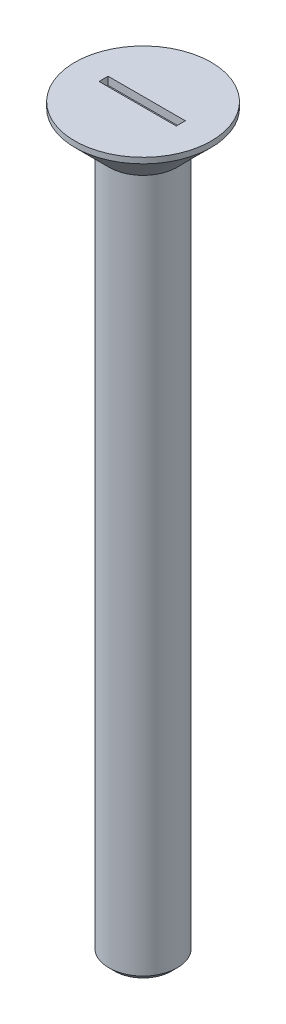
ISO-10303-21;
HEADER;
FILE_DESCRIPTION(('STEP AP214'),'2;1');
FILE_NAME('part.step','',(''),(''),'','','');
FILE_SCHEMA(('AUTOMOTIVE_DESIGN { 1 0 10303 214 1 1 1 1 }'));
ENDSEC;
DATA;
#1=APPLICATION_CONTEXT('core data for automotive mechanical design processes');
#2=APPLICATION_PROTOCOL_DEFINITION('international standard','automotive_design',2000,#1);
#3=PRODUCT_CONTEXT('',#1,'mechanical');
#4=PRODUCT('Part','Part','',(#3));
#5=PRODUCT_RELATED_PRODUCT_CATEGORY('part','',(#4));
#6=PRODUCT_DEFINITION_FORMATION('','',#4);
#7=PRODUCT_DEFINITION_CONTEXT('part definition',#1,'design');
#8=PRODUCT_DEFINITION('design','',#6,#7);
#9=PRODUCT_DEFINITION_SHAPE('','',#8);
#10=(LENGTH_UNIT() NAMED_UNIT(*) SI_UNIT(.MILLI.,.METRE.));
#11=(NAMED_UNIT(*) PLANE_ANGLE_UNIT() SI_UNIT($,.RADIAN.));
#12=(NAMED_UNIT(*) SI_UNIT($,.STERADIAN.) SOLID_ANGLE_UNIT());
#13=UNCERTAINTY_MEASURE_WITH_UNIT(LENGTH_MEASURE(1.E-05),#10,'distance_accuracy_value','');
#14=(GEOMETRIC_REPRESENTATION_CONTEXT(3) GLOBAL_UNCERTAINTY_ASSIGNED_CONTEXT((#13)) GLOBAL_UNIT_ASSIGNED_CONTEXT((#10,
#11,#12)) REPRESENTATION_CONTEXT('',''));
#15=CARTESIAN_POINT('',(0.,0.,0.));
#16=DIRECTION('',(0.,0.,1.));
#17=DIRECTION('',(1.,0.,0.));
#18=AXIS2_PLACEMENT_3D('',#15,#16,#17);
#19=CARTESIAN_POINT('',(0.,65.,0.));
#20=DIRECTION('',(0.,1.,0.));
#21=DIRECTION('',(0.,0.,1.));
#22=AXIS2_PLACEMENT_3D('',#19,#20,#21);
#23=PLANE('',#22);
#24=DIRECTION('',(0.,0.,1.));
#25=VECTOR('',#24,1.);
#26=CARTESIAN_POINT('',(-3.47194242119997,65.,0.4));
#27=LINE('',#26,#25);
#28=CARTESIAN_POINT('',(-3.47194242119997,65.,-0.4));
#29=VERTEX_POINT('',#28);
#30=CARTESIAN_POINT('',(-3.47194242119997,65.,0.4));
#31=VERTEX_POINT('',#30);
#32=EDGE_CURVE('E47',#29,#31,#27,.T.);
#33=ORIENTED_EDGE('',*,*,#32,.F.);
#34=DIRECTION('',(-1.,0.,0.));
#35=VECTOR('',#34,1.);
#36=CARTESIAN_POINT('',(-3.47194242119997,65.,-0.4));
#37=LINE('',#36,#35);
#38=CARTESIAN_POINT('',(3.32060070250861,65.,-0.400000000000001));
#39=VERTEX_POINT('',#38);
#40=EDGE_CURVE('E98',#39,#29,#37,.T.);
#41=ORIENTED_EDGE('',*,*,#40,.F.);
#42=DIRECTION('',(0.,0.,-1.));
#43=VECTOR('',#42,1.);
#44=CARTESIAN_POINT('',(3.32060070250861,65.,0.4));
#45=LINE('',#44,#43);
#46=CARTESIAN_POINT('',(3.32060070250861,65.,0.4));
#47=VERTEX_POINT('',#46);
#48=EDGE_CURVE('E104',#47,#39,#45,.T.);
#49=ORIENTED_EDGE('',*,*,#48,.F.);
#50=DIRECTION('',(1.,0.,0.));
#51=VECTOR('',#50,1.);
#52=CARTESIAN_POINT('',(-3.47194242119997,65.,0.4));
#53=LINE('',#52,#51);
#54=EDGE_CURVE('E82',#31,#47,#53,.T.);
#55=ORIENTED_EDGE('',*,*,#54,.F.);
#56=EDGE_LOOP('',(#33,#41,#49,#55));
#57=FACE_BOUND('',#56,.T.);
#58=CARTESIAN_POINT('',(0.,65.,0.));
#59=DIRECTION('',(0.,-1.,0.));
#60=DIRECTION('',(0.,0.,-1.));
#61=AXIS2_PLACEMENT_3D('',#58,#59,#60);
#62=CIRCLE('',#61,6.);
#63=CARTESIAN_POINT('',(0.,65.,-6.));
#64=VERTEX_POINT('',#63);
#65=EDGE_CURVE('E116',#64,#64,#62,.T.);
#66=ORIENTED_EDGE('',*,*,#65,.F.);
#67=EDGE_LOOP('',(#66));
#68=FACE_BOUND('',#67,.T.);
#69=ADVANCED_FACE('F32',(#57,#68),#23,.T.);
#70=CARTESIAN_POINT('',(0.,-8.5328125,0.));
#71=DIRECTION('',(0.,-1.,0.));
#72=DIRECTION('',(0.,0.,-1.));
#73=AXIS2_PLACEMENT_3D('',#70,#71,#72);
#74=CYLINDRICAL_SURFACE('',#73,6.);
#75=ORIENTED_EDGE('',*,*,#65,.T.);
#76=EDGE_LOOP('',(#75));
#77=FACE_BOUND('',#76,.T.);
#78=CARTESIAN_POINT('',(0.,64.5,0.));
#79=DIRECTION('',(0.,-1.,0.));
#80=DIRECTION('',(0.,0.,-1.));
#81=AXIS2_PLACEMENT_3D('',#78,#79,#80);
#82=CIRCLE('',#81,6.);
#83=CARTESIAN_POINT('',(0.,64.5,-6.));
#84=VERTEX_POINT('',#83);
#85=EDGE_CURVE('E113',#84,#84,#82,.T.);
#86=ORIENTED_EDGE('',*,*,#85,.F.);
#87=EDGE_LOOP('',(#86));
#88=FACE_BOUND('',#87,.T.);
#89=ADVANCED_FACE('F131',(#77,#88),#74,.T.);
#90=CARTESIAN_POINT('',(0.,61.5,0.));
#91=DIRECTION('',(0.,1.,0.));
#92=DIRECTION('',(0.,0.,1.));
#93=AXIS2_PLACEMENT_3D('',#90,#91,#92);
#94=CONICAL_SURFACE('',#93,3.,0.785398163397443);
#95=ORIENTED_EDGE('',*,*,#85,.T.);
#96=EDGE_LOOP('',(#95));
#97=FACE_BOUND('',#96,.T.);
#98=CARTESIAN_POINT('',(0.,61.5,0.));
#99=DIRECTION('',(0.,-1.,0.));
#100=DIRECTION('',(0.,0.,-1.));
#101=AXIS2_PLACEMENT_3D('',#98,#99,#100);
#102=CIRCLE('',#101,3.);
#103=CARTESIAN_POINT('',(0.,61.5,-3.));
#104=VERTEX_POINT('',#103);
#105=EDGE_CURVE('E108',#104,#104,#102,.T.);
#106=ORIENTED_EDGE('',*,*,#105,.F.);
#107=EDGE_LOOP('',(#106));
#108=FACE_BOUND('',#107,.T.);
#109=ADVANCED_FACE('F136',(#97,#108),#94,.T.);
#110=CARTESIAN_POINT('',(0.,-8.5328125,0.));
#111=DIRECTION('',(0.,-1.,0.));
#112=DIRECTION('',(0.,0.,-1.));
#113=AXIS2_PLACEMENT_3D('',#110,#111,#112);
#114=CYLINDRICAL_SURFACE('',#113,3.);
#115=CARTESIAN_POINT('',(0.,0.500000000000002,0.));
#116=DIRECTION('',(0.,-1.,0.));
#117=DIRECTION('',(0.,0.,-1.));
#118=AXIS2_PLACEMENT_3D('',#115,#116,#117);
#119=CIRCLE('',#118,3.);
#120=CARTESIAN_POINT('',(0.,0.500000000000002,-3.));
#121=VERTEX_POINT('',#120);
#122=EDGE_CURVE('E11',#121,#121,#119,.F.);
#123=ORIENTED_EDGE('',*,*,#122,.T.);
#124=EDGE_LOOP('',(#123));
#125=FACE_BOUND('',#124,.T.);
#126=ORIENTED_EDGE('',*,*,#105,.T.);
#127=EDGE_LOOP('',(#126));
#128=FACE_BOUND('',#127,.T.);
#129=ADVANCED_FACE('F143',(#125,#128),#114,.T.);
#130=CARTESIAN_POINT('',(0.,0.,0.));
#131=DIRECTION('',(0.,-1.,0.));
#132=DIRECTION('',(0.,0.,-1.));
#133=AXIS2_PLACEMENT_3D('',#130,#131,#132);
#134=PLANE('',#133);
#135=CARTESIAN_POINT('',(0.,0.,0.));
#136=DIRECTION('',(0.,-1.,0.));
#137=DIRECTION('',(0.,0.,-1.));
#138=AXIS2_PLACEMENT_3D('',#135,#136,#137);
#139=CIRCLE('',#138,2.5);
#140=CARTESIAN_POINT('',(0.,0.,-2.5));
#141=VERTEX_POINT('',#140);
#142=EDGE_CURVE('E40',#141,#141,#139,.T.);
#143=ORIENTED_EDGE('',*,*,#142,.T.);
#144=EDGE_LOOP('',(#143));
#145=FACE_BOUND('',#144,.T.);
#146=ADVANCED_FACE('F121',(#145),#134,.T.);
#147=CARTESIAN_POINT('',(-3.47194242119997,64.3,0.4));
#148=DIRECTION('',(-1.,0.,0.));
#149=DIRECTION('',(0.,0.,1.));
#150=AXIS2_PLACEMENT_3D('',#147,#148,#149);
#151=PLANE('',#150);
#152=ORIENTED_EDGE('',*,*,#32,.T.);
#153=DIRECTION('',(0.,1.,0.));
#154=VECTOR('',#153,1.);
#155=CARTESIAN_POINT('',(-3.47194242119997,64.3,0.4));
#156=LINE('',#155,#154);
#157=CARTESIAN_POINT('',(-3.47194242119997,64.3,0.4));
#158=VERTEX_POINT('',#157);
#159=EDGE_CURVE('E70',#158,#31,#156,.T.);
#160=ORIENTED_EDGE('',*,*,#159,.F.);
#161=DIRECTION('',(0.,0.,1.));
#162=VECTOR('',#161,1.);
#163=CARTESIAN_POINT('',(-3.47194242119997,64.3,0.4));
#164=LINE('',#163,#162);
#165=CARTESIAN_POINT('',(-3.47194242119997,64.3,-0.4));
#166=VERTEX_POINT('',#165);
#167=EDGE_CURVE('E96',#166,#158,#164,.T.);
#168=ORIENTED_EDGE('',*,*,#167,.F.);
#169=DIRECTION('',(0.,1.,0.));
#170=VECTOR('',#169,1.);
#171=CARTESIAN_POINT('',(-3.47194242119997,64.3,-0.4));
#172=LINE('',#171,#170);
#173=EDGE_CURVE('E55',#166,#29,#172,.T.);
#174=ORIENTED_EDGE('',*,*,#173,.T.);
#175=EDGE_LOOP('',(#152,#160,#168,#174));
#176=FACE_BOUND('',#175,.T.);
#177=ADVANCED_FACE('F150',(#176),#151,.F.);
#178=CARTESIAN_POINT('',(-3.47194242119997,64.3,-0.4));
#179=DIRECTION('',(0.,0.,-1.));
#180=DIRECTION('',(-1.,0.,0.));
#181=AXIS2_PLACEMENT_3D('',#178,#179,#180);
#182=PLANE('',#181);
#183=ORIENTED_EDGE('',*,*,#40,.T.);
#184=ORIENTED_EDGE('',*,*,#173,.F.);
#185=DIRECTION('',(-1.,0.,0.));
#186=VECTOR('',#185,1.);
#187=CARTESIAN_POINT('',(-3.47194242119997,64.3,-0.4));
#188=LINE('',#187,#186);
#189=CARTESIAN_POINT('',(3.32060070250861,64.3,-0.400000000000001));
#190=VERTEX_POINT('',#189);
#191=EDGE_CURVE('E93',#190,#166,#188,.T.);
#192=ORIENTED_EDGE('',*,*,#191,.F.);
#193=DIRECTION('',(0.,1.,0.));
#194=VECTOR('',#193,1.);
#195=CARTESIAN_POINT('',(3.32060070250861,64.3,-0.400000000000001));
#196=LINE('',#195,#194);
#197=EDGE_CURVE('E86',#190,#39,#196,.T.);
#198=ORIENTED_EDGE('',*,*,#197,.T.);
#199=EDGE_LOOP('',(#183,#184,#192,#198));
#200=FACE_BOUND('',#199,.T.);
#201=ADVANCED_FACE('F153',(#200),#182,.F.);
#202=CARTESIAN_POINT('',(3.32060070250861,64.3,0.4));
#203=DIRECTION('',(1.,0.,0.));
#204=DIRECTION('',(0.,0.,-1.));
#205=AXIS2_PLACEMENT_3D('',#202,#203,#204);
#206=PLANE('',#205);
#207=ORIENTED_EDGE('',*,*,#48,.T.);
#208=ORIENTED_EDGE('',*,*,#197,.F.);
#209=DIRECTION('',(0.,0.,-1.));
#210=VECTOR('',#209,1.);
#211=CARTESIAN_POINT('',(3.32060070250861,64.3,0.4));
#212=LINE('',#211,#210);
#213=CARTESIAN_POINT('',(3.32060070250861,64.3,0.4));
#214=VERTEX_POINT('',#213);
#215=EDGE_CURVE('E89',#214,#190,#212,.T.);
#216=ORIENTED_EDGE('',*,*,#215,.F.);
#217=DIRECTION('',(0.,1.,0.));
#218=VECTOR('',#217,1.);
#219=CARTESIAN_POINT('',(3.32060070250861,64.3,0.4));
#220=LINE('',#219,#218);
#221=EDGE_CURVE('E75',#214,#47,#220,.T.);
#222=ORIENTED_EDGE('',*,*,#221,.T.);
#223=EDGE_LOOP('',(#207,#208,#216,#222));
#224=FACE_BOUND('',#223,.T.);
#225=ADVANCED_FACE('F90',(#224),#206,.F.);
#226=CARTESIAN_POINT('',(-3.47194242119997,64.3,0.4));
#227=DIRECTION('',(0.,0.,1.));
#228=DIRECTION('',(1.,0.,0.));
#229=AXIS2_PLACEMENT_3D('',#226,#227,#228);
#230=PLANE('',#229);
#231=ORIENTED_EDGE('',*,*,#54,.T.);
#232=ORIENTED_EDGE('',*,*,#221,.F.);
#233=DIRECTION('',(1.,0.,0.));
#234=VECTOR('',#233,1.);
#235=CARTESIAN_POINT('',(-3.47194242119997,64.3,0.4));
#236=LINE('',#235,#234);
#237=EDGE_CURVE('E79',#158,#214,#236,.T.);
#238=ORIENTED_EDGE('',*,*,#237,.F.);
#239=ORIENTED_EDGE('',*,*,#159,.T.);
#240=EDGE_LOOP('',(#231,#232,#238,#239));
#241=FACE_BOUND('',#240,.T.);
#242=ADVANCED_FACE('F77',(#241),#230,.F.);
#243=CARTESIAN_POINT('',(-3.47194242119997,64.3,0.4));
#244=DIRECTION('',(0.,-1.,0.));
#245=DIRECTION('',(0.,0.,-1.));
#246=AXIS2_PLACEMENT_3D('',#243,#244,#245);
#247=PLANE('',#246);
#248=ORIENTED_EDGE('',*,*,#167,.T.);
#249=ORIENTED_EDGE('',*,*,#237,.T.);
#250=ORIENTED_EDGE('',*,*,#215,.T.);
#251=ORIENTED_EDGE('',*,*,#191,.T.);
#252=EDGE_LOOP('',(#248,#249,#250,#251));
#253=FACE_BOUND('',#252,.T.);
#254=ADVANCED_FACE('F95',(#253),#247,.F.);
#255=CARTESIAN_POINT('',(0.,0.,0.));
#256=DIRECTION('',(0.,1.,0.));
#257=DIRECTION('',(0.,0.,1.));
#258=AXIS2_PLACEMENT_3D('',#255,#256,#257);
#259=CONICAL_SURFACE('',#258,2.5,0.785398163397446);
#260=ORIENTED_EDGE('',*,*,#122,.F.);
#261=EDGE_LOOP('',(#260));
#262=FACE_BOUND('',#261,.T.);
#263=ORIENTED_EDGE('',*,*,#142,.F.);
#264=EDGE_LOOP('',(#263));
#265=FACE_BOUND('',#264,.T.);
#266=ADVANCED_FACE('F34',(#262,#265),#259,.T.);
#267=CLOSED_SHELL('',(#69,#89,#109,#129,#146,#177,#201,#225,#242,#254,#266));
#268=MANIFOLD_SOLID_BREP('B2',#267);
#269=ADVANCED_BREP_SHAPE_REPRESENTATION('',(#18,#268),#14);
#270=SHAPE_DEFINITION_REPRESENTATION(#9,#269);
ENDSEC;
END-ISO-10303-21;
